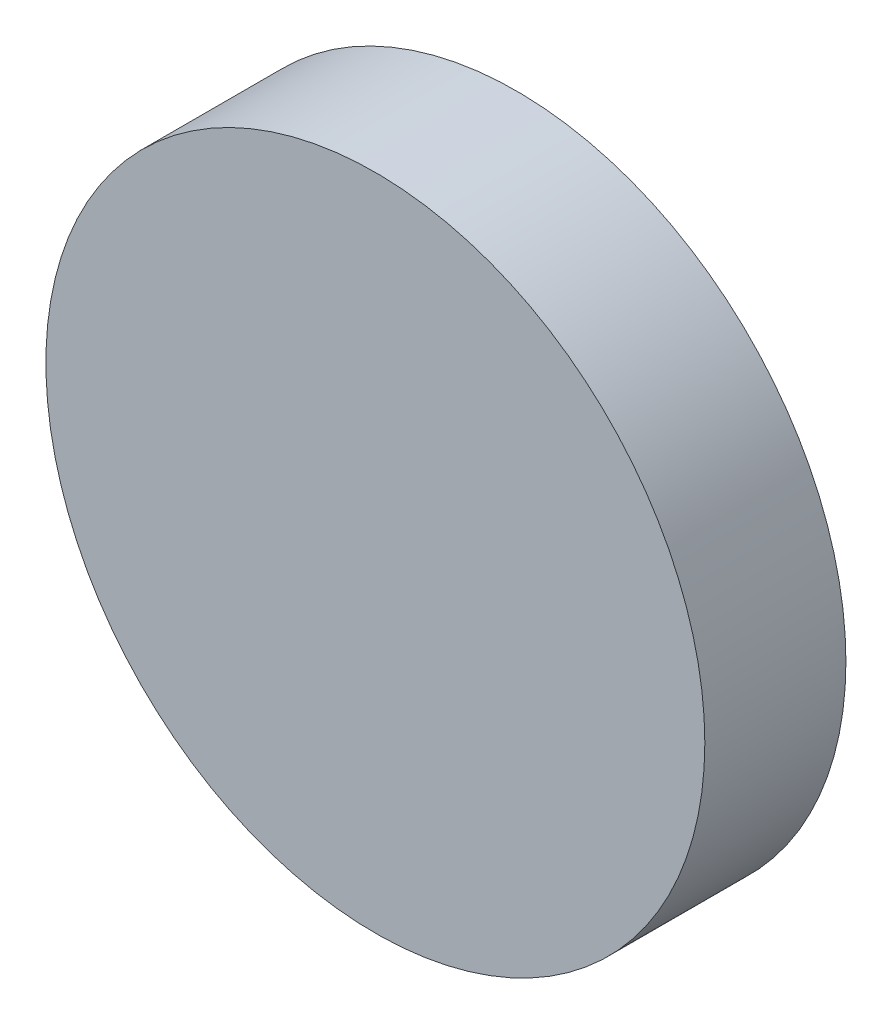
ISO-10303-21;
HEADER;
FILE_DESCRIPTION(('STEP AP214'),'2;1');
FILE_NAME('part.step','',(''),(''),'','','');
FILE_SCHEMA(('AUTOMOTIVE_DESIGN { 1 0 10303 214 1 1 1 1 }'));
ENDSEC;
DATA;
#1=APPLICATION_CONTEXT('core data for automotive mechanical design processes');
#2=APPLICATION_PROTOCOL_DEFINITION('international standard','automotive_design',2000,#1);
#3=PRODUCT_CONTEXT('',#1,'mechanical');
#4=PRODUCT('Part','Part','',(#3));
#5=PRODUCT_RELATED_PRODUCT_CATEGORY('part','',(#4));
#6=PRODUCT_DEFINITION_FORMATION('','',#4);
#7=PRODUCT_DEFINITION_CONTEXT('part definition',#1,'design');
#8=PRODUCT_DEFINITION('design','',#6,#7);
#9=PRODUCT_DEFINITION_SHAPE('','',#8);
#10=(LENGTH_UNIT() NAMED_UNIT(*) SI_UNIT(.MILLI.,.METRE.));
#11=(NAMED_UNIT(*) PLANE_ANGLE_UNIT() SI_UNIT($,.RADIAN.));
#12=(NAMED_UNIT(*) SI_UNIT($,.STERADIAN.) SOLID_ANGLE_UNIT());
#13=UNCERTAINTY_MEASURE_WITH_UNIT(LENGTH_MEASURE(1.E-05),#10,'distance_accuracy_value','');
#14=(GEOMETRIC_REPRESENTATION_CONTEXT(3) GLOBAL_UNCERTAINTY_ASSIGNED_CONTEXT((#13)) GLOBAL_UNIT_ASSIGNED_CONTEXT((#10,
#11,#12)) REPRESENTATION_CONTEXT('',''));
#15=CARTESIAN_POINT('',(0.,0.,0.));
#16=DIRECTION('',(0.,0.,1.));
#17=DIRECTION('',(1.,0.,0.));
#18=AXIS2_PLACEMENT_3D('',#15,#16,#17);
#19=CARTESIAN_POINT('',(-17.6985022447471,13.2252544246462,0.));
#20=DIRECTION('',(0.,0.,1.));
#21=DIRECTION('',(1.,0.,0.));
#22=AXIS2_PLACEMENT_3D('',#19,#20,#21);
#23=PLANE('',#22);
#24=CARTESIAN_POINT('',(-17.6985022447471,13.2252544246462,0.));
#25=DIRECTION('',(0.,0.,1.));
#26=DIRECTION('',(1.,0.,0.));
#27=AXIS2_PLACEMENT_3D('',#24,#25,#26);
#28=CIRCLE('',#27,53.3821213001114);
#29=CARTESIAN_POINT('',(35.6836190553644,13.2252544246462,0.));
#30=VERTEX_POINT('',#29);
#31=EDGE_CURVE('E10',#30,#30,#28,.T.);
#32=ORIENTED_EDGE('',*,*,#31,.F.);
#33=EDGE_LOOP('',(#32));
#34=FACE_BOUND('',#33,.T.);
#35=CARTESIAN_POINT('',(-17.6985022447471,13.2252544246462,0.));
#36=DIRECTION('',(0.,0.,1.));
#37=DIRECTION('',(1.,0.,0.));
#38=AXIS2_PLACEMENT_3D('',#35,#36,#37);
#39=CIRCLE('',#38,50.8);
#40=CARTESIAN_POINT('',(33.1014977552529,13.2252544246462,0.));
#41=VERTEX_POINT('',#40);
#42=EDGE_CURVE('E45',#41,#41,#39,.T.);
#43=ORIENTED_EDGE('',*,*,#42,.T.);
#44=EDGE_LOOP('',(#43));
#45=FACE_BOUND('',#44,.T.);
#46=ADVANCED_FACE('F37',(#34,#45),#23,.F.);
#47=CARTESIAN_POINT('',(-17.6985022447471,13.2252544246462,20.32));
#48=DIRECTION('',(0.,0.,-1.));
#49=DIRECTION('',(-1.,0.,0.));
#50=AXIS2_PLACEMENT_3D('',#47,#48,#49);
#51=CYLINDRICAL_SURFACE('',#50,53.3821213001114);
#52=ORIENTED_EDGE('',*,*,#31,.T.);
#53=EDGE_LOOP('',(#52));
#54=FACE_BOUND('',#53,.T.);
#55=CARTESIAN_POINT('',(-17.6985022447471,13.2252544246462,22.86));
#56=DIRECTION('',(0.,0.,1.));
#57=DIRECTION('',(1.,0.,0.));
#58=AXIS2_PLACEMENT_3D('',#55,#56,#57);
#59=CIRCLE('',#58,53.3821213001114);
#60=CARTESIAN_POINT('',(35.6836190553644,13.2252544246462,22.86));
#61=VERTEX_POINT('',#60);
#62=EDGE_CURVE('E55',#61,#61,#59,.T.);
#63=ORIENTED_EDGE('',*,*,#62,.F.);
#64=EDGE_LOOP('',(#63));
#65=FACE_BOUND('',#64,.T.);
#66=ADVANCED_FACE('F39',(#54,#65),#51,.T.);
#67=CARTESIAN_POINT('',(-17.6985022447471,13.2252544246462,20.32));
#68=DIRECTION('',(0.,0.,-1.));
#69=DIRECTION('',(-1.,0.,0.));
#70=AXIS2_PLACEMENT_3D('',#67,#68,#69);
#71=CYLINDRICAL_SURFACE('',#70,50.8);
#72=CARTESIAN_POINT('',(-17.6985022447471,13.2252544246462,20.32));
#73=DIRECTION('',(0.,0.,1.));
#74=DIRECTION('',(1.,0.,0.));
#75=AXIS2_PLACEMENT_3D('',#72,#73,#74);
#76=CIRCLE('',#75,50.8);
#77=CARTESIAN_POINT('',(33.1014977552529,13.2252544246462,20.32));
#78=VERTEX_POINT('',#77);
#79=EDGE_CURVE('E50',#78,#78,#76,.T.);
#80=ORIENTED_EDGE('',*,*,#79,.T.);
#81=EDGE_LOOP('',(#80));
#82=FACE_BOUND('',#81,.T.);
#83=ORIENTED_EDGE('',*,*,#42,.F.);
#84=EDGE_LOOP('',(#83));
#85=FACE_BOUND('',#84,.T.);
#86=ADVANCED_FACE('F65',(#82,#85),#71,.F.);
#87=CARTESIAN_POINT('',(-17.6985022447471,13.2252544246462,20.32));
#88=DIRECTION('',(0.,0.,1.));
#89=DIRECTION('',(1.,0.,0.));
#90=AXIS2_PLACEMENT_3D('',#87,#88,#89);
#91=PLANE('',#90);
#92=ORIENTED_EDGE('',*,*,#79,.F.);
#93=EDGE_LOOP('',(#92));
#94=FACE_BOUND('',#93,.T.);
#95=ADVANCED_FACE('F70',(#94),#91,.F.);
#96=CARTESIAN_POINT('',(-17.6985022447471,13.2252544246462,22.86));
#97=DIRECTION('',(0.,0.,1.));
#98=DIRECTION('',(1.,0.,0.));
#99=AXIS2_PLACEMENT_3D('',#96,#97,#98);
#100=PLANE('',#99);
#101=ORIENTED_EDGE('',*,*,#62,.T.);
#102=EDGE_LOOP('',(#101));
#103=FACE_BOUND('',#102,.T.);
#104=ADVANCED_FACE('F62',(#103),#100,.T.);
#105=CLOSED_SHELL('',(#46,#66,#86,#95,#104));
#106=MANIFOLD_SOLID_BREP('B2',#105);
#107=ADVANCED_BREP_SHAPE_REPRESENTATION('',(#18,#106),#14);
#108=SHAPE_DEFINITION_REPRESENTATION(#9,#107);
ENDSEC;
END-ISO-10303-21;
